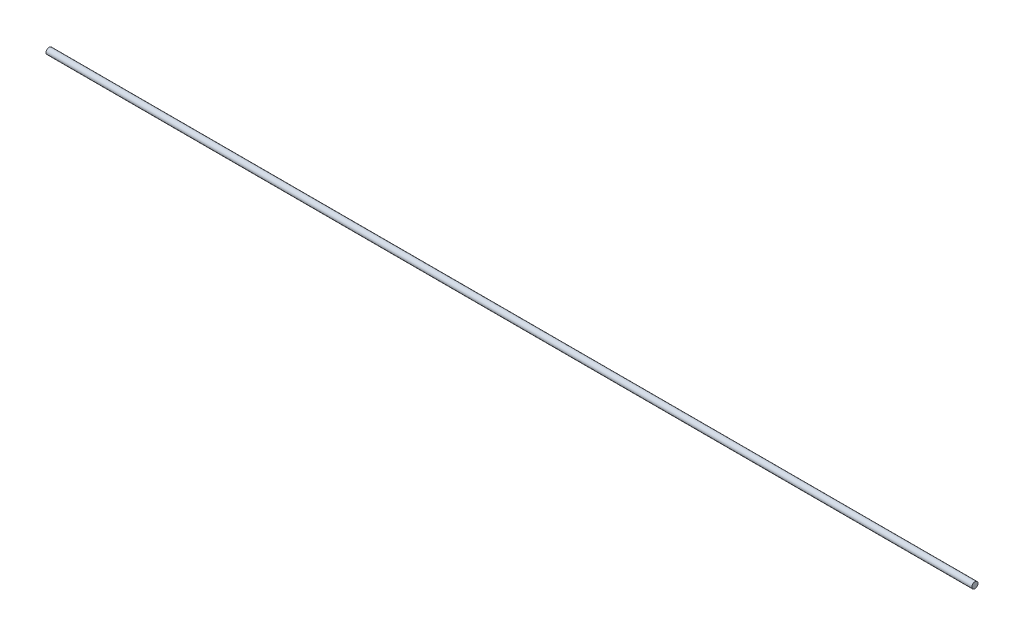
ISO-10303-21;
HEADER;
FILE_DESCRIPTION(('STEP AP214'),'2;1');
FILE_NAME('part.step','',(''),(''),'','','');
FILE_SCHEMA(('AUTOMOTIVE_DESIGN { 1 0 10303 214 1 1 1 1 }'));
ENDSEC;
DATA;
#1=APPLICATION_CONTEXT('core data for automotive mechanical design processes');
#2=APPLICATION_PROTOCOL_DEFINITION('international standard','automotive_design',2000,#1);
#3=PRODUCT_CONTEXT('',#1,'mechanical');
#4=PRODUCT('Part','Part','',(#3));
#5=PRODUCT_RELATED_PRODUCT_CATEGORY('part','',(#4));
#6=PRODUCT_DEFINITION_FORMATION('','',#4);
#7=PRODUCT_DEFINITION_CONTEXT('part definition',#1,'design');
#8=PRODUCT_DEFINITION('design','',#6,#7);
#9=PRODUCT_DEFINITION_SHAPE('','',#8);
#10=(LENGTH_UNIT() NAMED_UNIT(*) SI_UNIT(.MILLI.,.METRE.));
#11=(NAMED_UNIT(*) PLANE_ANGLE_UNIT() SI_UNIT($,.RADIAN.));
#12=(NAMED_UNIT(*) SI_UNIT($,.STERADIAN.) SOLID_ANGLE_UNIT());
#13=UNCERTAINTY_MEASURE_WITH_UNIT(LENGTH_MEASURE(1.E-05),#10,'distance_accuracy_value','');
#14=(GEOMETRIC_REPRESENTATION_CONTEXT(3) GLOBAL_UNCERTAINTY_ASSIGNED_CONTEXT((#13)) GLOBAL_UNIT_ASSIGNED_CONTEXT((#10,
#11,#12)) REPRESENTATION_CONTEXT('',''));
#15=CARTESIAN_POINT('',(0.,0.,0.));
#16=DIRECTION('',(0.,0.,1.));
#17=DIRECTION('',(1.,0.,0.));
#18=AXIS2_PLACEMENT_3D('',#15,#16,#17);
#19=CARTESIAN_POINT('',(18.,0.,0.));
#20=DIRECTION('',(-1.,0.,0.));
#21=DIRECTION('',(0.,0.,1.));
#22=AXIS2_PLACEMENT_3D('',#19,#20,#21);
#23=CYLINDRICAL_SURFACE('',#22,0.0599999999999999);
#24=CARTESIAN_POINT('',(18.,0.,0.));
#25=DIRECTION('',(1.,0.,0.));
#26=DIRECTION('',(0.,0.,-1.));
#27=AXIS2_PLACEMENT_3D('',#24,#25,#26);
#28=CIRCLE('',#27,0.0599999999999999);
#29=CARTESIAN_POINT('',(18.,0.,-0.0599999999999999));
#30=VERTEX_POINT('',#29);
#31=EDGE_CURVE('E10',#30,#30,#28,.T.);
#32=ORIENTED_EDGE('',*,*,#31,.F.);
#33=EDGE_LOOP('',(#32));
#34=FACE_BOUND('',#33,.T.);
#35=CARTESIAN_POINT('',(0.,0.,0.));
#36=DIRECTION('',(1.,0.,0.));
#37=DIRECTION('',(0.,0.,-1.));
#38=AXIS2_PLACEMENT_3D('',#35,#36,#37);
#39=CIRCLE('',#38,0.0599999999999999);
#40=CARTESIAN_POINT('',(0.,0.,-0.0599999999999999));
#41=VERTEX_POINT('',#40);
#42=EDGE_CURVE('E29',#41,#41,#39,.T.);
#43=ORIENTED_EDGE('',*,*,#42,.T.);
#44=EDGE_LOOP('',(#43));
#45=FACE_BOUND('',#44,.T.);
#46=ADVANCED_FACE('F26',(#34,#45),#23,.T.);
#47=CARTESIAN_POINT('',(18.,0.,0.));
#48=DIRECTION('',(1.,0.,0.));
#49=DIRECTION('',(0.,0.,-1.));
#50=AXIS2_PLACEMENT_3D('',#47,#48,#49);
#51=PLANE('',#50);
#52=ORIENTED_EDGE('',*,*,#31,.T.);
#53=EDGE_LOOP('',(#52));
#54=FACE_BOUND('',#53,.T.);
#55=ADVANCED_FACE('F41',(#54),#51,.T.);
#56=CARTESIAN_POINT('',(0.,0.,0.));
#57=DIRECTION('',(1.,0.,0.));
#58=DIRECTION('',(0.,0.,-1.));
#59=AXIS2_PLACEMENT_3D('',#56,#57,#58);
#60=PLANE('',#59);
#61=ORIENTED_EDGE('',*,*,#42,.F.);
#62=EDGE_LOOP('',(#61));
#63=FACE_BOUND('',#62,.T.);
#64=ADVANCED_FACE('F39',(#63),#60,.F.);
#65=CLOSED_SHELL('',(#46,#55,#64));
#66=MANIFOLD_SOLID_BREP('B2',#65);
#67=ADVANCED_BREP_SHAPE_REPRESENTATION('',(#18,#66),#14);
#68=SHAPE_DEFINITION_REPRESENTATION(#9,#67);
ENDSEC;
END-ISO-10303-21;
